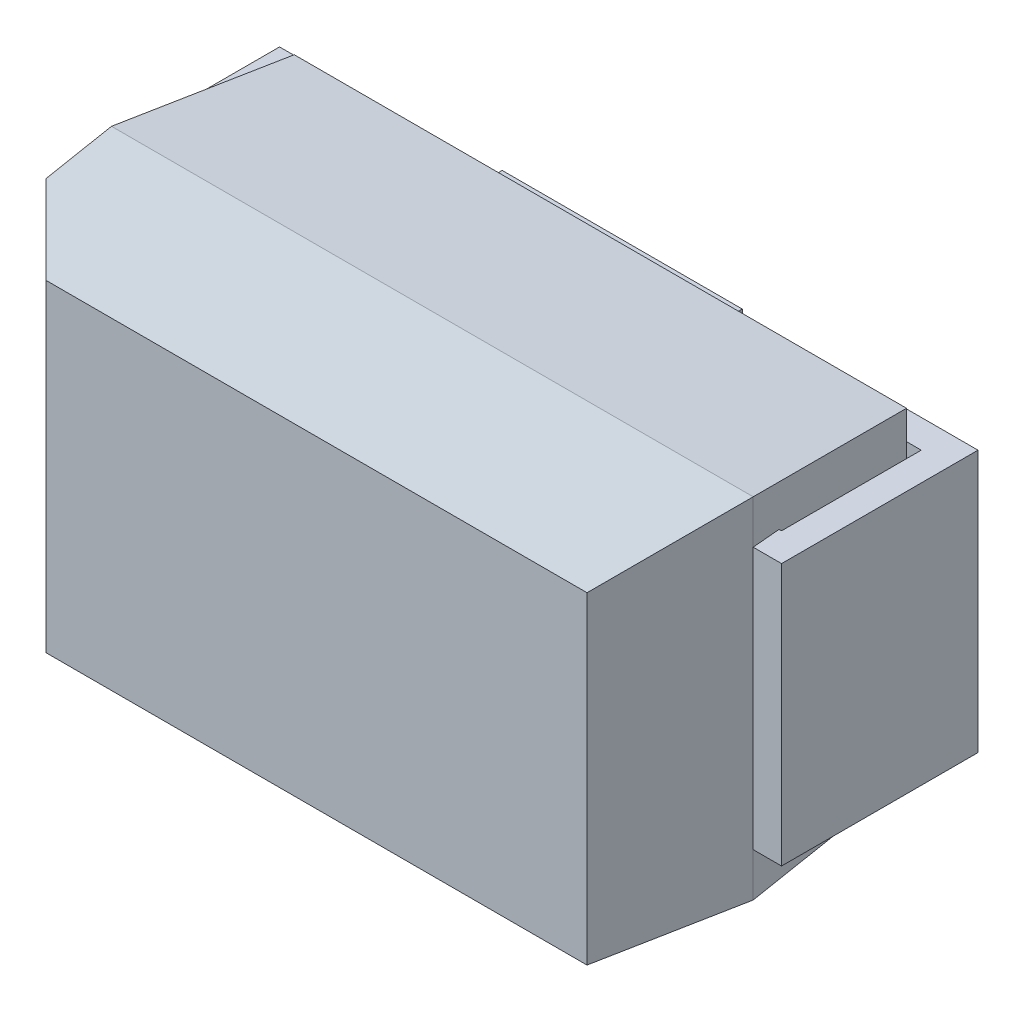
ISO-10303-21;
HEADER;
FILE_DESCRIPTION(('STEP AP214'),'2;1');
FILE_NAME('part.step','',(''),(''),'','','');
FILE_SCHEMA(('AUTOMOTIVE_DESIGN { 1 0 10303 214 1 1 1 1 }'));
ENDSEC;
DATA;
#1=APPLICATION_CONTEXT('core data for automotive mechanical design processes');
#2=APPLICATION_PROTOCOL_DEFINITION('international standard','automotive_design',2000,#1);
#3=PRODUCT_CONTEXT('',#1,'mechanical');
#4=PRODUCT('Part','Part','',(#3));
#5=PRODUCT_RELATED_PRODUCT_CATEGORY('part','',(#4));
#6=PRODUCT_DEFINITION_FORMATION('','',#4);
#7=PRODUCT_DEFINITION_CONTEXT('part definition',#1,'design');
#8=PRODUCT_DEFINITION('design','',#6,#7);
#9=PRODUCT_DEFINITION_SHAPE('','',#8);
#10=(LENGTH_UNIT() NAMED_UNIT(*) SI_UNIT(.MILLI.,.METRE.));
#11=(NAMED_UNIT(*) PLANE_ANGLE_UNIT() SI_UNIT($,.RADIAN.));
#12=(NAMED_UNIT(*) SI_UNIT($,.STERADIAN.) SOLID_ANGLE_UNIT());
#13=UNCERTAINTY_MEASURE_WITH_UNIT(LENGTH_MEASURE(1.E-05),#10,'distance_accuracy_value','');
#14=(GEOMETRIC_REPRESENTATION_CONTEXT(3) GLOBAL_UNCERTAINTY_ASSIGNED_CONTEXT((#13)) GLOBAL_UNIT_ASSIGNED_CONTEXT((#10,
#11,#12)) REPRESENTATION_CONTEXT('',''));
#15=CARTESIAN_POINT('',(0.,0.,0.));
#16=DIRECTION('',(0.,0.,1.));
#17=DIRECTION('',(1.,0.,0.));
#18=AXIS2_PLACEMENT_3D('',#15,#16,#17);
#19=CARTESIAN_POINT('',(1.616,-0.624,0.));
#20=DIRECTION('',(0.,0.,-1.));
#21=DIRECTION('',(-1.,0.,0.));
#22=AXIS2_PLACEMENT_3D('',#19,#20,#21);
#23=PLANE('',#22);
#24=DIRECTION('',(-1.,0.,0.));
#25=VECTOR('',#24,1.);
#26=CARTESIAN_POINT('',(0.,0.6,0.));
#27=LINE('',#26,#25);
#28=CARTESIAN_POINT('',(0.8,0.6,0.));
#29=VERTEX_POINT('',#28);
#30=CARTESIAN_POINT('',(1.6,0.6,0.));
#31=VERTEX_POINT('',#30);
#32=EDGE_CURVE('E356',#29,#31,#27,.F.);
#33=ORIENTED_EDGE('',*,*,#32,.T.);
#34=DIRECTION('',(0.,1.,0.));
#35=VECTOR('',#34,1.);
#36=CARTESIAN_POINT('',(1.6,0.,0.));
#37=LINE('',#36,#35);
#38=CARTESIAN_POINT('',(1.6,-0.6,0.));
#39=VERTEX_POINT('',#38);
#40=EDGE_CURVE('E384',#31,#39,#37,.F.);
#41=ORIENTED_EDGE('',*,*,#40,.T.);
#42=DIRECTION('',(-1.,0.,0.));
#43=VECTOR('',#42,1.);
#44=CARTESIAN_POINT('',(0.,-0.6,0.));
#45=LINE('',#44,#43);
#46=CARTESIAN_POINT('',(0.8,-0.6,0.));
#47=VERTEX_POINT('',#46);
#48=EDGE_CURVE('E367',#39,#47,#45,.T.);
#49=ORIENTED_EDGE('',*,*,#48,.T.);
#50=DIRECTION('',(0.,-1.,0.));
#51=VECTOR('',#50,1.);
#52=CARTESIAN_POINT('',(0.8,0.,0.));
#53=LINE('',#52,#51);
#54=EDGE_CURVE('E362',#47,#29,#53,.F.);
#55=ORIENTED_EDGE('',*,*,#54,.T.);
#56=EDGE_LOOP('',(#33,#41,#49,#55));
#57=FACE_BOUND('',#56,.T.);
#58=ADVANCED_FACE('F16',(#57),#23,.T.);
#59=CARTESIAN_POINT('',(1.47,-0.624,0.1172));
#60=DIRECTION('',(-1.,0.,0.));
#61=DIRECTION('',(0.,0.,1.));
#62=AXIS2_PLACEMENT_3D('',#59,#60,#61);
#63=PLANE('',#62);
#64=DIRECTION('',(0.,0.,1.));
#65=VECTOR('',#64,1.);
#66=CARTESIAN_POINT('',(1.47,0.6,0.45));
#67=LINE('',#66,#65);
#68=CARTESIAN_POINT('',(1.47,0.6,0.77));
#69=VERTEX_POINT('',#68);
#70=CARTESIAN_POINT('',(1.47,0.6,0.13));
#71=VERTEX_POINT('',#70);
#72=EDGE_CURVE('E348',#69,#71,#67,.F.);
#73=ORIENTED_EDGE('',*,*,#72,.T.);
#74=DIRECTION('',(0.,1.,0.));
#75=VECTOR('',#74,1.);
#76=CARTESIAN_POINT('',(1.47,0.,0.13));
#77=LINE('',#76,#75);
#78=CARTESIAN_POINT('',(1.47,-0.6,0.13));
#79=VERTEX_POINT('',#78);
#80=EDGE_CURVE('E382',#71,#79,#77,.F.);
#81=ORIENTED_EDGE('',*,*,#80,.T.);
#82=DIRECTION('',(0.,0.,1.));
#83=VECTOR('',#82,1.);
#84=CARTESIAN_POINT('',(1.47,-0.6,0.45));
#85=LINE('',#84,#83);
#86=CARTESIAN_POINT('',(1.47,-0.6,0.77));
#87=VERTEX_POINT('',#86);
#88=EDGE_CURVE('E374',#79,#87,#85,.T.);
#89=ORIENTED_EDGE('',*,*,#88,.T.);
#90=DIRECTION('',(0.,-1.,0.));
#91=VECTOR('',#90,1.);
#92=CARTESIAN_POINT('',(1.47,0.,0.77));
#93=LINE('',#92,#91);
#94=EDGE_CURVE('E380',#87,#69,#93,.F.);
#95=ORIENTED_EDGE('',*,*,#94,.T.);
#96=EDGE_LOOP('',(#73,#81,#89,#95));
#97=FACE_BOUND('',#96,.T.);
#98=ADVANCED_FACE('F621',(#97),#63,.T.);
#99=CARTESIAN_POINT('',(-0.572,-0.676,0.03));
#100=DIRECTION('',(0.,0.,1.));
#101=DIRECTION('',(1.,0.,0.));
#102=AXIS2_PLACEMENT_3D('',#99,#100,#101);
#103=PLANE('',#102);
#104=DIRECTION('',(0.,1.,0.));
#105=VECTOR('',#104,1.);
#106=CARTESIAN_POINT('',(0.55,0.,0.03));
#107=LINE('',#106,#105);
#108=CARTESIAN_POINT('',(0.55,0.65,0.03));
#109=VERTEX_POINT('',#108);
#110=CARTESIAN_POINT('',(0.55,-0.65,0.03));
#111=VERTEX_POINT('',#110);
#112=EDGE_CURVE('E331',#109,#111,#107,.F.);
#113=ORIENTED_EDGE('',*,*,#112,.T.);
#114=DIRECTION('',(1.,0.,0.));
#115=VECTOR('',#114,1.);
#116=CARTESIAN_POINT('',(0.,-0.65,0.03));
#117=LINE('',#116,#115);
#118=CARTESIAN_POINT('',(-0.55,-0.65,0.03));
#119=VERTEX_POINT('',#118);
#120=EDGE_CURVE('E325',#111,#119,#117,.F.);
#121=ORIENTED_EDGE('',*,*,#120,.T.);
#122=DIRECTION('',(0.,-1.,0.));
#123=VECTOR('',#122,1.);
#124=CARTESIAN_POINT('',(-0.55,0.,0.03));
#125=LINE('',#124,#123);
#126=CARTESIAN_POINT('',(-0.55,0.65,0.03));
#127=VERTEX_POINT('',#126);
#128=EDGE_CURVE('E341',#119,#127,#125,.F.);
#129=ORIENTED_EDGE('',*,*,#128,.T.);
#130=DIRECTION('',(-1.,0.,0.));
#131=VECTOR('',#130,1.);
#132=CARTESIAN_POINT('',(0.,0.65,0.03));
#133=LINE('',#132,#131);
#134=EDGE_CURVE('E336',#127,#109,#133,.F.);
#135=ORIENTED_EDGE('',*,*,#134,.T.);
#136=EDGE_LOOP('',(#113,#121,#129,#135));
#137=FACE_BOUND('',#136,.T.);
#138=ADVANCED_FACE('F617',(#137),#103,.F.);
#139=CARTESIAN_POINT('',(-0.784,-0.624,0.));
#140=DIRECTION('',(0.,0.,-1.));
#141=DIRECTION('',(-1.,0.,0.));
#142=AXIS2_PLACEMENT_3D('',#139,#140,#141);
#143=PLANE('',#142);
#144=DIRECTION('',(-1.,0.,0.));
#145=VECTOR('',#144,1.);
#146=CARTESIAN_POINT('',(0.,0.6,0.));
#147=LINE('',#146,#145);
#148=CARTESIAN_POINT('',(-1.6,0.6,0.));
#149=VERTEX_POINT('',#148);
#150=CARTESIAN_POINT('',(-0.8,0.6,0.));
#151=VERTEX_POINT('',#150);
#152=EDGE_CURVE('E308',#149,#151,#147,.F.);
#153=ORIENTED_EDGE('',*,*,#152,.T.);
#154=DIRECTION('',(0.,1.,0.));
#155=VECTOR('',#154,1.);
#156=CARTESIAN_POINT('',(-0.8,0.,0.));
#157=LINE('',#156,#155);
#158=CARTESIAN_POINT('',(-0.8,-0.6,0.));
#159=VERTEX_POINT('',#158);
#160=EDGE_CURVE('E343',#151,#159,#157,.F.);
#161=ORIENTED_EDGE('',*,*,#160,.T.);
#162=DIRECTION('',(-1.,0.,0.));
#163=VECTOR('',#162,1.);
#164=CARTESIAN_POINT('',(0.,-0.6,0.));
#165=LINE('',#164,#163);
#166=CARTESIAN_POINT('',(-1.6,-0.6,0.));
#167=VERTEX_POINT('',#166);
#168=EDGE_CURVE('E295',#159,#167,#165,.T.);
#169=ORIENTED_EDGE('',*,*,#168,.T.);
#170=DIRECTION('',(0.,-1.,0.));
#171=VECTOR('',#170,1.);
#172=CARTESIAN_POINT('',(-1.6,0.,0.));
#173=LINE('',#172,#171);
#174=EDGE_CURVE('E388',#167,#149,#173,.F.);
#175=ORIENTED_EDGE('',*,*,#174,.T.);
#176=EDGE_LOOP('',(#153,#161,#169,#175));
#177=FACE_BOUND('',#176,.T.);
#178=ADVANCED_FACE('F613',(#177),#143,.T.);
#179=CARTESIAN_POINT('',(-1.6,-0.624,-0.018));
#180=DIRECTION('',(-1.,0.,0.));
#181=DIRECTION('',(0.,0.,1.));
#182=AXIS2_PLACEMENT_3D('',#179,#180,#181);
#183=PLANE('',#182);
#184=DIRECTION('',(0.,0.,1.));
#185=VECTOR('',#184,1.);
#186=CARTESIAN_POINT('',(-1.6,0.6,0.45));
#187=LINE('',#186,#185);
#188=CARTESIAN_POINT('',(-1.6,0.6,0.9));
#189=VERTEX_POINT('',#188);
#190=EDGE_CURVE('E311',#189,#149,#187,.F.);
#191=ORIENTED_EDGE('',*,*,#190,.T.);
#192=ORIENTED_EDGE('',*,*,#174,.F.);
#193=DIRECTION('',(0.,0.,1.));
#194=VECTOR('',#193,1.);
#195=CARTESIAN_POINT('',(-1.6,-0.6,0.45));
#196=LINE('',#195,#194);
#197=CARTESIAN_POINT('',(-1.6,-0.6,0.9));
#198=VERTEX_POINT('',#197);
#199=EDGE_CURVE('E292',#167,#198,#196,.T.);
#200=ORIENTED_EDGE('',*,*,#199,.T.);
#201=DIRECTION('',(0.,-1.,0.));
#202=VECTOR('',#201,1.);
#203=CARTESIAN_POINT('',(-1.6,0.,0.9));
#204=LINE('',#203,#202);
#205=EDGE_CURVE('E386',#198,#189,#204,.F.);
#206=ORIENTED_EDGE('',*,*,#205,.T.);
#207=EDGE_LOOP('',(#191,#192,#200,#206));
#208=FACE_BOUND('',#207,.T.);
#209=ADVANCED_FACE('F609',(#208),#183,.T.);
#210=CARTESIAN_POINT('',(-1.47,-0.624,0.7828));
#211=DIRECTION('',(1.,0.,0.));
#212=DIRECTION('',(0.,0.,-1.));
#213=AXIS2_PLACEMENT_3D('',#210,#211,#212);
#214=PLANE('',#213);
#215=DIRECTION('',(0.,0.,-1.));
#216=VECTOR('',#215,1.);
#217=CARTESIAN_POINT('',(-1.47,0.6,0.45));
#218=LINE('',#217,#216);
#219=CARTESIAN_POINT('',(-1.47,0.6,0.13));
#220=VERTEX_POINT('',#219);
#221=CARTESIAN_POINT('',(-1.47,0.6,0.77));
#222=VERTEX_POINT('',#221);
#223=EDGE_CURVE('E315',#220,#222,#218,.F.);
#224=ORIENTED_EDGE('',*,*,#223,.T.);
#225=DIRECTION('',(0.,1.,0.));
#226=VECTOR('',#225,1.);
#227=CARTESIAN_POINT('',(-1.47,0.,0.77));
#228=LINE('',#227,#226);
#229=CARTESIAN_POINT('',(-1.47,-0.6,0.77));
#230=VERTEX_POINT('',#229);
#231=EDGE_CURVE('E301',#222,#230,#228,.F.);
#232=ORIENTED_EDGE('',*,*,#231,.T.);
#233=DIRECTION('',(0.,0.,-1.));
#234=VECTOR('',#233,1.);
#235=CARTESIAN_POINT('',(-1.47,-0.6,0.45));
#236=LINE('',#235,#234);
#237=CARTESIAN_POINT('',(-1.47,-0.6,0.13));
#238=VERTEX_POINT('',#237);
#239=EDGE_CURVE('E281',#230,#238,#236,.T.);
#240=ORIENTED_EDGE('',*,*,#239,.T.);
#241=DIRECTION('',(0.,-1.,0.));
#242=VECTOR('',#241,1.);
#243=CARTESIAN_POINT('',(-1.47,0.,0.13));
#244=LINE('',#243,#242);
#245=EDGE_CURVE('E320',#238,#220,#244,.F.);
#246=ORIENTED_EDGE('',*,*,#245,.T.);
#247=EDGE_LOOP('',(#224,#232,#240,#246));
#248=FACE_BOUND('',#247,.T.);
#249=ADVANCED_FACE('F606',(#248),#214,.T.);
#250=CARTESIAN_POINT('',(-1.604703020306,-0.624,0.9));
#251=DIRECTION('',(0.,0.,1.));
#252=DIRECTION('',(1.,0.,0.));
#253=AXIS2_PLACEMENT_3D('',#250,#251,#252);
#254=PLANE('',#253);
#255=ORIENTED_EDGE('',*,*,#205,.F.);
#256=DIRECTION('',(1.,0.,0.));
#257=VECTOR('',#256,1.);
#258=CARTESIAN_POINT('',(0.,-0.6,0.9));
#259=LINE('',#258,#257);
#260=CARTESIAN_POINT('',(-1.46999999999999,-0.6,0.900000000000005));
#261=VERTEX_POINT('',#260);
#262=EDGE_CURVE('E290',#198,#261,#259,.T.);
#263=ORIENTED_EDGE('',*,*,#262,.T.);
#264=DIRECTION('',(0.,-1.,0.));
#265=VECTOR('',#264,1.);
#266=CARTESIAN_POINT('',(-1.47000000000021,0.,0.900000000000018));
#267=LINE('',#266,#265);
#268=CARTESIAN_POINT('',(-1.47000000000002,0.6,0.900000000000008));
#269=VERTEX_POINT('',#268);
#270=EDGE_CURVE('E274',#261,#269,#267,.F.);
#271=ORIENTED_EDGE('',*,*,#270,.T.);
#272=DIRECTION('',(1.,0.,0.));
#273=VECTOR('',#272,1.);
#274=CARTESIAN_POINT('',(0.,0.6,0.9));
#275=LINE('',#274,#273);
#276=EDGE_CURVE('E82',#269,#189,#275,.F.);
#277=ORIENTED_EDGE('',*,*,#276,.T.);
#278=EDGE_LOOP('',(#255,#263,#271,#277));
#279=FACE_BOUND('',#278,.T.);
#280=ADVANCED_FACE('F491',(#279),#254,.T.);
#281=CARTESIAN_POINT('',(1.6,-0.624,0.918));
#282=DIRECTION('',(1.,0.,0.));
#283=DIRECTION('',(0.,0.,-1.));
#284=AXIS2_PLACEMENT_3D('',#281,#282,#283);
#285=PLANE('',#284);
#286=DIRECTION('',(0.,0.,-1.));
#287=VECTOR('',#286,1.);
#288=CARTESIAN_POINT('',(1.6,0.6,0.45));
#289=LINE('',#288,#287);
#290=CARTESIAN_POINT('',(1.6,0.6,0.9));
#291=VERTEX_POINT('',#290);
#292=EDGE_CURVE('E354',#31,#291,#289,.F.);
#293=ORIENTED_EDGE('',*,*,#292,.T.);
#294=DIRECTION('',(0.,1.,0.));
#295=VECTOR('',#294,1.);
#296=CARTESIAN_POINT('',(1.6,0.,0.9));
#297=LINE('',#296,#295);
#298=CARTESIAN_POINT('',(1.6,-0.6,0.9));
#299=VERTEX_POINT('',#298);
#300=EDGE_CURVE('E272',#291,#299,#297,.F.);
#301=ORIENTED_EDGE('',*,*,#300,.T.);
#302=DIRECTION('',(0.,0.,-1.));
#303=VECTOR('',#302,1.);
#304=CARTESIAN_POINT('',(1.6,-0.6,0.45));
#305=LINE('',#304,#303);
#306=EDGE_CURVE('E369',#299,#39,#305,.T.);
#307=ORIENTED_EDGE('',*,*,#306,.T.);
#308=ORIENTED_EDGE('',*,*,#40,.F.);
#309=EDGE_LOOP('',(#293,#301,#307,#308));
#310=FACE_BOUND('',#309,.T.);
#311=ADVANCED_FACE('F461',(#310),#285,.T.);
#312=CARTESIAN_POINT('',(1.397930708779,-0.624,0.13));
#313=DIRECTION('',(0.,0.,1.));
#314=DIRECTION('',(1.,0.,0.));
#315=AXIS2_PLACEMENT_3D('',#312,#313,#314);
#316=PLANE('',#315);
#317=ORIENTED_EDGE('',*,*,#80,.F.);
#318=DIRECTION('',(1.,0.,0.));
#319=VECTOR('',#318,1.);
#320=CARTESIAN_POINT('',(0.,0.6,0.13));
#321=LINE('',#320,#319);
#322=CARTESIAN_POINT('',(1.40263372908504,0.6,0.129999999999997));
#323=VERTEX_POINT('',#322);
#324=EDGE_CURVE('E345',#71,#323,#321,.F.);
#325=ORIENTED_EDGE('',*,*,#324,.T.);
#326=DIRECTION('',(0.,1.,0.));
#327=VECTOR('',#326,1.);
#328=CARTESIAN_POINT('',(1.40263372908529,0.,0.129999999999975));
#329=LINE('',#328,#327);
#330=CARTESIAN_POINT('',(1.40263372908504,-0.6,0.129999999999997));
#331=VERTEX_POINT('',#330);
#332=EDGE_CURVE('E453',#323,#331,#329,.F.);
#333=ORIENTED_EDGE('',*,*,#332,.T.);
#334=DIRECTION('',(1.,0.,0.));
#335=VECTOR('',#334,1.);
#336=CARTESIAN_POINT('',(0.,-0.6,0.13));
#337=LINE('',#336,#335);
#338=EDGE_CURVE('E377',#331,#79,#337,.T.);
#339=ORIENTED_EDGE('',*,*,#338,.T.);
#340=EDGE_LOOP('',(#317,#325,#333,#339));
#341=FACE_BOUND('',#340,.T.);
#342=ADVANCED_FACE('F523',(#341),#316,.T.);
#343=CARTESIAN_POINT('',(1.5288,-0.624,0.77));
#344=DIRECTION('',(0.,0.,-1.));
#345=DIRECTION('',(-1.,0.,0.));
#346=AXIS2_PLACEMENT_3D('',#343,#344,#345);
#347=PLANE('',#346);
#348=ORIENTED_EDGE('',*,*,#94,.F.);
#349=DIRECTION('',(-1.,0.,0.));
#350=VECTOR('',#349,1.);
#351=CARTESIAN_POINT('',(0.,-0.6,0.77));
#352=LINE('',#351,#350);
#353=CARTESIAN_POINT('',(1.45862647374186,-0.6,0.770000000000012));
#354=VERTEX_POINT('',#353);
#355=EDGE_CURVE('E372',#87,#354,#352,.T.);
#356=ORIENTED_EDGE('',*,*,#355,.T.);
#357=DIRECTION('',(0.,-1.,0.));
#358=VECTOR('',#357,1.);
#359=CARTESIAN_POINT('',(1.45862647374144,0.,0.770000000000049));
#360=LINE('',#359,#358);
#361=CARTESIAN_POINT('',(1.45862647374186,0.6,0.770000000000012));
#362=VERTEX_POINT('',#361);
#363=EDGE_CURVE('E447',#354,#362,#360,.F.);
#364=ORIENTED_EDGE('',*,*,#363,.T.);
#365=DIRECTION('',(-1.,0.,0.));
#366=VECTOR('',#365,1.);
#367=CARTESIAN_POINT('',(0.,0.6,0.77));
#368=LINE('',#367,#366);
#369=EDGE_CURVE('E351',#362,#69,#368,.F.);
#370=ORIENTED_EDGE('',*,*,#369,.T.);
#371=EDGE_LOOP('',(#348,#356,#364,#370));
#372=FACE_BOUND('',#371,.T.);
#373=ADVANCED_FACE('F596',(#372),#347,.T.);
#374=CARTESIAN_POINT('',(-1.664,-0.6,0.918));
#375=DIRECTION('',(0.,1.,0.));
#376=DIRECTION('',(1.,0.,0.));
#377=AXIS2_PLACEMENT_3D('',#374,#375,#376);
#378=PLANE('',#377);
#379=ORIENTED_EDGE('',*,*,#48,.F.);
#380=ORIENTED_EDGE('',*,*,#306,.F.);
#381=DIRECTION('',(1.,0.,0.));
#382=VECTOR('',#381,1.);
#383=CARTESIAN_POINT('',(1.535,-0.6,0.9));
#384=LINE('',#383,#382);
#385=CARTESIAN_POINT('',(1.46999999999992,-0.6,0.899999999999999));
#386=VERTEX_POINT('',#385);
#387=EDGE_CURVE('E456',#299,#386,#384,.F.);
#388=ORIENTED_EDGE('',*,*,#387,.T.);
#389=DIRECTION('',(0.0871557427469669,0.,0.996194698091806));
#390=VECTOR('',#389,1.);
#391=CARTESIAN_POINT('',(1.4363168645425,-0.6,0.515));
#392=LINE('',#391,#390);
#393=EDGE_CURVE('E450',#386,#354,#392,.F.);
#394=ORIENTED_EDGE('',*,*,#393,.T.);
#395=ORIENTED_EDGE('',*,*,#355,.F.);
#396=ORIENTED_EDGE('',*,*,#88,.F.);
#397=ORIENTED_EDGE('',*,*,#338,.F.);
#398=DIRECTION('',(1.,0.,0.));
#399=VECTOR('',#398,1.);
#400=CARTESIAN_POINT('',(0.,-0.6,0.13));
#401=LINE('',#400,#399);
#402=CARTESIAN_POINT('',(0.8,-0.6,0.13));
#403=VERTEX_POINT('',#402);
#404=EDGE_CURVE('E266',#331,#403,#401,.F.);
#405=ORIENTED_EDGE('',*,*,#404,.T.);
#406=DIRECTION('',(0.,0.,1.));
#407=VECTOR('',#406,1.);
#408=CARTESIAN_POINT('',(0.8,-0.6,0.064999999999978));
#409=LINE('',#408,#407);
#410=EDGE_CURVE('E364',#403,#47,#409,.F.);
#411=ORIENTED_EDGE('',*,*,#410,.T.);
#412=EDGE_LOOP('',(#379,#380,#388,#394,#395,#396,#397,#405,#411));
#413=FACE_BOUND('',#412,.T.);
#414=ADVANCED_FACE('F511',(#413),#378,.F.);
#415=CARTESIAN_POINT('',(0.8,-0.624,-0.004703020306144));
#416=DIRECTION('',(-1.,0.,0.));
#417=DIRECTION('',(0.,0.,1.));
#418=AXIS2_PLACEMENT_3D('',#415,#416,#417);
#419=PLANE('',#418);
#420=ORIENTED_EDGE('',*,*,#54,.F.);
#421=ORIENTED_EDGE('',*,*,#410,.F.);
#422=DIRECTION('',(0.,-1.,0.));
#423=VECTOR('',#422,1.);
#424=CARTESIAN_POINT('',(0.8,0.,0.13));
#425=LINE('',#424,#423);
#426=CARTESIAN_POINT('',(0.8,0.6,0.13));
#427=VERTEX_POINT('',#426);
#428=EDGE_CURVE('E440',#403,#427,#425,.F.);
#429=ORIENTED_EDGE('',*,*,#428,.T.);
#430=DIRECTION('',(0.,0.,1.));
#431=VECTOR('',#430,1.);
#432=CARTESIAN_POINT('',(0.8,0.6,0.45));
#433=LINE('',#432,#431);
#434=EDGE_CURVE('E359',#427,#29,#433,.F.);
#435=ORIENTED_EDGE('',*,*,#434,.T.);
#436=EDGE_LOOP('',(#420,#421,#429,#435));
#437=FACE_BOUND('',#436,.T.);
#438=ADVANCED_FACE('F515',(#437),#419,.T.);
#439=CARTESIAN_POINT('',(-1.664,0.6,0.918));
#440=DIRECTION('',(0.,1.,0.));
#441=DIRECTION('',(1.,0.,0.));
#442=AXIS2_PLACEMENT_3D('',#439,#440,#441);
#443=PLANE('',#442);
#444=ORIENTED_EDGE('',*,*,#72,.F.);
#445=ORIENTED_EDGE('',*,*,#369,.F.);
#446=DIRECTION('',(-0.0871557427469672,0.,-0.996194698091806));
#447=VECTOR('',#446,1.);
#448=CARTESIAN_POINT('',(1.4363168645425,0.6,0.515));
#449=LINE('',#448,#447);
#450=CARTESIAN_POINT('',(1.46999999999992,0.6,0.899999999999999));
#451=VERTEX_POINT('',#450);
#452=EDGE_CURVE('E267',#362,#451,#449,.F.);
#453=ORIENTED_EDGE('',*,*,#452,.T.);
#454=DIRECTION('',(-1.,0.,0.));
#455=VECTOR('',#454,1.);
#456=CARTESIAN_POINT('',(1.535,0.6,0.9));
#457=LINE('',#456,#455);
#458=EDGE_CURVE('E269',#451,#291,#457,.F.);
#459=ORIENTED_EDGE('',*,*,#458,.T.);
#460=ORIENTED_EDGE('',*,*,#292,.F.);
#461=ORIENTED_EDGE('',*,*,#32,.F.);
#462=ORIENTED_EDGE('',*,*,#434,.F.);
#463=DIRECTION('',(-1.,0.,0.));
#464=VECTOR('',#463,1.);
#465=CARTESIAN_POINT('',(0.,0.6,0.13));
#466=LINE('',#465,#464);
#467=EDGE_CURVE('E406',#427,#323,#466,.F.);
#468=ORIENTED_EDGE('',*,*,#467,.T.);
#469=ORIENTED_EDGE('',*,*,#324,.F.);
#470=EDGE_LOOP('',(#444,#445,#453,#459,#460,#461,#462,#468,#469));
#471=FACE_BOUND('',#470,.T.);
#472=ADVANCED_FACE('F471',(#471),#443,.T.);
#473=CARTESIAN_POINT('',(-0.8,-0.624,0.1347030203061));
#474=DIRECTION('',(1.,0.,0.));
#475=DIRECTION('',(0.,0.,-1.));
#476=AXIS2_PLACEMENT_3D('',#473,#474,#475);
#477=PLANE('',#476);
#478=ORIENTED_EDGE('',*,*,#160,.F.);
#479=DIRECTION('',(0.,0.,-1.));
#480=VECTOR('',#479,1.);
#481=CARTESIAN_POINT('',(-0.8,0.6,0.45));
#482=LINE('',#481,#480);
#483=CARTESIAN_POINT('',(-0.8,0.6,0.13));
#484=VERTEX_POINT('',#483);
#485=EDGE_CURVE('E306',#151,#484,#482,.F.);
#486=ORIENTED_EDGE('',*,*,#485,.T.);
#487=DIRECTION('',(0.,1.,0.));
#488=VECTOR('',#487,1.);
#489=CARTESIAN_POINT('',(-0.8,0.,0.13));
#490=LINE('',#489,#488);
#491=CARTESIAN_POINT('',(-0.8,-0.6,0.13));
#492=VERTEX_POINT('',#491);
#493=EDGE_CURVE('E433',#484,#492,#490,.F.);
#494=ORIENTED_EDGE('',*,*,#493,.T.);
#495=DIRECTION('',(0.,0.,-1.));
#496=VECTOR('',#495,1.);
#497=CARTESIAN_POINT('',(-0.8,-0.6,0.45));
#498=LINE('',#497,#496);
#499=EDGE_CURVE('E298',#492,#159,#498,.T.);
#500=ORIENTED_EDGE('',*,*,#499,.T.);
#501=EDGE_LOOP('',(#478,#486,#494,#500));
#502=FACE_BOUND('',#501,.T.);
#503=ADVANCED_FACE('F585',(#502),#477,.T.);
#504=CARTESIAN_POINT('',(-0.55,0.676,0.02529697969386));
#505=DIRECTION('',(-1.,0.,0.));
#506=DIRECTION('',(0.,-1.,0.));
#507=AXIS2_PLACEMENT_3D('',#504,#505,#506);
#508=PLANE('',#507);
#509=ORIENTED_EDGE('',*,*,#128,.F.);
#510=DIRECTION('',(0.,0.,-1.));
#511=VECTOR('',#510,1.);
#512=CARTESIAN_POINT('',(-0.55,-0.65,0.07999999999998));
#513=LINE('',#512,#511);
#514=CARTESIAN_POINT('',(-0.55,-0.65,0.13));
#515=VERTEX_POINT('',#514);
#516=EDGE_CURVE('E322',#119,#515,#513,.F.);
#517=ORIENTED_EDGE('',*,*,#516,.T.);
#518=DIRECTION('',(0.,-1.,0.));
#519=VECTOR('',#518,1.);
#520=CARTESIAN_POINT('',(-0.55,0.,0.13));
#521=LINE('',#520,#519);
#522=CARTESIAN_POINT('',(-0.55,0.65,0.13));
#523=VERTEX_POINT('',#522);
#524=EDGE_CURVE('E239',#515,#523,#521,.F.);
#525=ORIENTED_EDGE('',*,*,#524,.T.);
#526=DIRECTION('',(0.,0.,1.));
#527=VECTOR('',#526,1.);
#528=CARTESIAN_POINT('',(-0.55,0.65,0.07999999999998));
#529=LINE('',#528,#527);
#530=EDGE_CURVE('E338',#523,#127,#529,.F.);
#531=ORIENTED_EDGE('',*,*,#530,.T.);
#532=EDGE_LOOP('',(#509,#517,#525,#531));
#533=FACE_BOUND('',#532,.T.);
#534=ADVANCED_FACE('F581',(#533),#508,.T.);
#535=CARTESIAN_POINT('',(0.572,0.65,0.02529697969386));
#536=DIRECTION('',(0.,1.,0.));
#537=DIRECTION('',(-1.,0.,0.));
#538=AXIS2_PLACEMENT_3D('',#535,#536,#537);
#539=PLANE('',#538);
#540=ORIENTED_EDGE('',*,*,#134,.F.);
#541=ORIENTED_EDGE('',*,*,#530,.F.);
#542=DIRECTION('',(-1.,0.,0.));
#543=VECTOR('',#542,1.);
#544=CARTESIAN_POINT('',(0.,0.65,0.13));
#545=LINE('',#544,#543);
#546=CARTESIAN_POINT('',(0.55,0.65,0.13));
#547=VERTEX_POINT('',#546);
#548=EDGE_CURVE('E426',#523,#547,#545,.F.);
#549=ORIENTED_EDGE('',*,*,#548,.T.);
#550=DIRECTION('',(0.,0.,1.));
#551=VECTOR('',#550,1.);
#552=CARTESIAN_POINT('',(0.55,0.65,0.07999999999998));
#553=LINE('',#552,#551);
#554=EDGE_CURVE('E333',#547,#109,#553,.F.);
#555=ORIENTED_EDGE('',*,*,#554,.T.);
#556=EDGE_LOOP('',(#540,#541,#549,#555));
#557=FACE_BOUND('',#556,.T.);
#558=ADVANCED_FACE('F577',(#557),#539,.T.);
#559=CARTESIAN_POINT('',(0.55,-0.676,0.02529697969386));
#560=DIRECTION('',(1.,0.,0.));
#561=DIRECTION('',(0.,1.,0.));
#562=AXIS2_PLACEMENT_3D('',#559,#560,#561);
#563=PLANE('',#562);
#564=ORIENTED_EDGE('',*,*,#112,.F.);
#565=ORIENTED_EDGE('',*,*,#554,.F.);
#566=DIRECTION('',(0.,1.,0.));
#567=VECTOR('',#566,1.);
#568=CARTESIAN_POINT('',(0.55,0.,0.13));
#569=LINE('',#568,#567);
#570=CARTESIAN_POINT('',(0.55,-0.65,0.13));
#571=VERTEX_POINT('',#570);
#572=EDGE_CURVE('E419',#547,#571,#569,.F.);
#573=ORIENTED_EDGE('',*,*,#572,.T.);
#574=DIRECTION('',(0.,0.,1.));
#575=VECTOR('',#574,1.);
#576=CARTESIAN_POINT('',(0.55,-0.65,0.07999999999998));
#577=LINE('',#576,#575);
#578=EDGE_CURVE('E328',#571,#111,#577,.F.);
#579=ORIENTED_EDGE('',*,*,#578,.T.);
#580=EDGE_LOOP('',(#564,#565,#573,#579));
#581=FACE_BOUND('',#580,.T.);
#582=ADVANCED_FACE('F573',(#581),#563,.T.);
#583=CARTESIAN_POINT('',(-0.572,-0.65,0.02529697969386));
#584=DIRECTION('',(0.,-1.,0.));
#585=DIRECTION('',(1.,0.,0.));
#586=AXIS2_PLACEMENT_3D('',#583,#584,#585);
#587=PLANE('',#586);
#588=ORIENTED_EDGE('',*,*,#120,.F.);
#589=ORIENTED_EDGE('',*,*,#578,.F.);
#590=DIRECTION('',(1.,0.,0.));
#591=VECTOR('',#590,1.);
#592=CARTESIAN_POINT('',(0.,-0.65,0.13));
#593=LINE('',#592,#591);
#594=EDGE_CURVE('E414',#571,#515,#593,.F.);
#595=ORIENTED_EDGE('',*,*,#594,.T.);
#596=ORIENTED_EDGE('',*,*,#516,.F.);
#597=EDGE_LOOP('',(#588,#589,#595,#596));
#598=FACE_BOUND('',#597,.T.);
#599=ADVANCED_FACE('F570',(#598),#587,.T.);
#600=CARTESIAN_POINT('',(-1.474703020306,-0.624,0.13));
#601=DIRECTION('',(0.,0.,1.));
#602=DIRECTION('',(1.,0.,0.));
#603=AXIS2_PLACEMENT_3D('',#600,#601,#602);
#604=PLANE('',#603);
#605=ORIENTED_EDGE('',*,*,#245,.F.);
#606=DIRECTION('',(1.,0.,0.));
#607=VECTOR('',#606,1.);
#608=CARTESIAN_POINT('',(0.,-0.6,0.13));
#609=LINE('',#608,#607);
#610=CARTESIAN_POINT('',(-1.40263372908504,-0.6,0.129999999999997));
#611=VERTEX_POINT('',#610);
#612=EDGE_CURVE('E275',#238,#611,#609,.T.);
#613=ORIENTED_EDGE('',*,*,#612,.T.);
#614=DIRECTION('',(0.,-1.,0.));
#615=VECTOR('',#614,1.);
#616=CARTESIAN_POINT('',(-1.40263372908529,0.,0.129999999999975));
#617=LINE('',#616,#615);
#618=CARTESIAN_POINT('',(-1.40263372908504,0.6,0.129999999999997));
#619=VERTEX_POINT('',#618);
#620=EDGE_CURVE('E408',#611,#619,#617,.F.);
#621=ORIENTED_EDGE('',*,*,#620,.T.);
#622=DIRECTION('',(1.,0.,0.));
#623=VECTOR('',#622,1.);
#624=CARTESIAN_POINT('',(0.,0.6,0.13));
#625=LINE('',#624,#623);
#626=EDGE_CURVE('E317',#619,#220,#625,.F.);
#627=ORIENTED_EDGE('',*,*,#626,.T.);
#628=EDGE_LOOP('',(#605,#613,#621,#627));
#629=FACE_BOUND('',#628,.T.);
#630=ADVANCED_FACE('F567',(#629),#604,.T.);
#631=CARTESIAN_POINT('',(-1.664,0.6,0.918));
#632=DIRECTION('',(0.,1.,0.));
#633=DIRECTION('',(1.,0.,0.));
#634=AXIS2_PLACEMENT_3D('',#631,#632,#633);
#635=PLANE('',#634);
#636=ORIENTED_EDGE('',*,*,#152,.F.);
#637=ORIENTED_EDGE('',*,*,#190,.F.);
#638=ORIENTED_EDGE('',*,*,#276,.F.);
#639=DIRECTION('',(-0.0871557427469669,0.,0.996194698091806));
#640=VECTOR('',#639,1.);
#641=CARTESIAN_POINT('',(-1.4363168645425,0.6,0.515));
#642=LINE('',#641,#640);
#643=CARTESIAN_POINT('',(-1.45862647374186,0.6,0.770000000000012));
#644=VERTEX_POINT('',#643);
#645=EDGE_CURVE('E398',#269,#644,#642,.F.);
#646=ORIENTED_EDGE('',*,*,#645,.T.);
#647=DIRECTION('',(1.,0.,0.));
#648=VECTOR('',#647,1.);
#649=CARTESIAN_POINT('',(0.,0.6,0.77));
#650=LINE('',#649,#648);
#651=EDGE_CURVE('E303',#644,#222,#650,.F.);
#652=ORIENTED_EDGE('',*,*,#651,.T.);
#653=ORIENTED_EDGE('',*,*,#223,.F.);
#654=ORIENTED_EDGE('',*,*,#626,.F.);
#655=DIRECTION('',(-1.,0.,0.));
#656=VECTOR('',#655,1.);
#657=CARTESIAN_POINT('',(0.,0.6,0.13));
#658=LINE('',#657,#656);
#659=EDGE_CURVE('E402',#619,#484,#658,.F.);
#660=ORIENTED_EDGE('',*,*,#659,.T.);
#661=ORIENTED_EDGE('',*,*,#485,.F.);
#662=EDGE_LOOP('',(#636,#637,#638,#646,#652,#653,#654,#660,#661));
#663=FACE_BOUND('',#662,.T.);
#664=ADVANCED_FACE('F563',(#663),#635,.T.);
#665=CARTESIAN_POINT('',(1.5288,-0.624,0.77));
#666=DIRECTION('',(0.,0.,-1.));
#667=DIRECTION('',(-1.,0.,0.));
#668=AXIS2_PLACEMENT_3D('',#665,#666,#667);
#669=PLANE('',#668);
#670=ORIENTED_EDGE('',*,*,#231,.F.);
#671=ORIENTED_EDGE('',*,*,#651,.F.);
#672=DIRECTION('',(0.,1.,0.));
#673=VECTOR('',#672,1.);
#674=CARTESIAN_POINT('',(-1.45862647374144,0.,0.770000000000049));
#675=LINE('',#674,#673);
#676=CARTESIAN_POINT('',(-1.45862647374186,-0.6,0.770000000000012));
#677=VERTEX_POINT('',#676);
#678=EDGE_CURVE('E501',#644,#677,#675,.F.);
#679=ORIENTED_EDGE('',*,*,#678,.T.);
#680=DIRECTION('',(-1.,0.,0.));
#681=VECTOR('',#680,1.);
#682=CARTESIAN_POINT('',(0.,-0.6,0.77));
#683=LINE('',#682,#681);
#684=EDGE_CURVE('E287',#677,#230,#683,.T.);
#685=ORIENTED_EDGE('',*,*,#684,.T.);
#686=EDGE_LOOP('',(#670,#671,#679,#685));
#687=FACE_BOUND('',#686,.T.);
#688=ADVANCED_FACE('F560',(#687),#669,.T.);
#689=CARTESIAN_POINT('',(-1.664,-0.6,0.918));
#690=DIRECTION('',(0.,1.,0.));
#691=DIRECTION('',(1.,0.,0.));
#692=AXIS2_PLACEMENT_3D('',#689,#690,#691);
#693=PLANE('',#692);
#694=ORIENTED_EDGE('',*,*,#239,.F.);
#695=ORIENTED_EDGE('',*,*,#684,.F.);
#696=DIRECTION('',(0.0871557427469672,0.,-0.996194698091806));
#697=VECTOR('',#696,1.);
#698=CARTESIAN_POINT('',(-1.4363168645425,-0.6,0.515));
#699=LINE('',#698,#697);
#700=EDGE_CURVE('E392',#677,#261,#699,.F.);
#701=ORIENTED_EDGE('',*,*,#700,.T.);
#702=ORIENTED_EDGE('',*,*,#262,.F.);
#703=ORIENTED_EDGE('',*,*,#199,.F.);
#704=ORIENTED_EDGE('',*,*,#168,.F.);
#705=ORIENTED_EDGE('',*,*,#499,.F.);
#706=DIRECTION('',(1.,0.,0.));
#707=VECTOR('',#706,1.);
#708=CARTESIAN_POINT('',(0.,-0.6,0.13));
#709=LINE('',#708,#707);
#710=EDGE_CURVE('E240',#492,#611,#709,.F.);
#711=ORIENTED_EDGE('',*,*,#710,.T.);
#712=ORIENTED_EDGE('',*,*,#612,.F.);
#713=EDGE_LOOP('',(#694,#695,#701,#702,#703,#704,#705,#711,#712));
#714=FACE_BOUND('',#713,.T.);
#715=ADVANCED_FACE('F500',(#714),#693,.F.);
#716=CARTESIAN_POINT('',(-1.470575260778,0.832,0.8934247392222));
#717=DIRECTION('',(-0.996194698091671,0.,0.0871557427485096));
#718=DIRECTION('',(0.,-1.,0.));
#719=AXIS2_PLACEMENT_3D('',#716,#717,#718);
#720=PLANE('',#719);
#721=DIRECTION('',(-0.0868265938650954,-0.0868265938642781,-0.99243250913889));
#722=VECTOR('',#721,1.);
#723=CARTESIAN_POINT('',(-1.44123696111081,-0.771236961110906,1.22876303888898));
#724=LINE('',#723,#722);
#725=CARTESIAN_POINT('',(-1.44123696111089,-0.771236961110895,1.22876303888911));
#726=VERTEX_POINT('',#725);
#727=CARTESIAN_POINT('',(-1.47000000000009,-0.800000000000027,0.900000000000772));
#728=VERTEX_POINT('',#727);
#729=EDGE_CURVE('E268',#726,#728,#724,.T.);
#730=ORIENTED_EDGE('',*,*,#729,.F.);
#731=DIRECTION('',(0.,-1.,0.));
#732=VECTOR('',#731,1.);
#733=CARTESIAN_POINT('',(-1.441236961111,0.,1.228763038889));
#734=LINE('',#733,#732);
#735=CARTESIAN_POINT('',(-1.44123696111089,0.771236961110895,1.2287630388891));
#736=VERTEX_POINT('',#735);
#737=EDGE_CURVE('E259',#726,#736,#734,.F.);
#738=ORIENTED_EDGE('',*,*,#737,.T.);
#739=DIRECTION('',(0.0868265938650953,-0.0868265938642781,0.99243250913889));
#740=VECTOR('',#739,1.);
#741=CARTESIAN_POINT('',(-1.47000000000021,0.800000000000035,0.900000000000021));
#742=LINE('',#741,#740);
#743=CARTESIAN_POINT('',(-1.47000000000009,0.800000000000027,0.900000000000765));
#744=VERTEX_POINT('',#743);
#745=EDGE_CURVE('E20',#744,#736,#742,.T.);
#746=ORIENTED_EDGE('',*,*,#745,.F.);
#747=DIRECTION('',(0.,1.,0.));
#748=VECTOR('',#747,1.);
#749=CARTESIAN_POINT('',(-1.46999999999971,0.,0.900000000000025));
#750=LINE('',#749,#748);
#751=EDGE_CURVE('E263',#744,#269,#750,.F.);
#752=ORIENTED_EDGE('',*,*,#751,.T.);
#753=ORIENTED_EDGE('',*,*,#270,.F.);
#754=DIRECTION('',(0.,1.,0.));
#755=VECTOR('',#754,1.);
#756=CARTESIAN_POINT('',(-1.46999999999971,0.,0.900000000000025));
#757=LINE('',#756,#755);
#758=EDGE_CURVE('E249',#261,#728,#757,.F.);
#759=ORIENTED_EDGE('',*,*,#758,.T.);
#760=EDGE_LOOP('',(#730,#738,#746,#752,#753,#759));
#761=FACE_BOUND('',#760,.T.);
#762=ADVANCED_FACE('F487',(#761),#720,.T.);
#763=CARTESIAN_POINT('',(1.5288,0.7312864036667,0.1146));
#764=DIRECTION('',(0.,0.996194698091741,-0.0871557427477079));
#765=DIRECTION('',(-1.,0.,0.));
#766=AXIS2_PLACEMENT_3D('',#763,#764,#765);
#767=PLANE('',#766);
#768=DIRECTION('',(-0.0868265938635589,-0.0868265938643023,-0.992432509139022));
#769=VECTOR('',#768,1.);
#770=CARTESIAN_POINT('',(1.46999999999971,0.800000000000002,0.900000000000025));
#771=LINE('',#770,#769);
#772=CARTESIAN_POINT('',(1.46999999999969,0.800000000000018,0.899999999999945));
#773=VERTEX_POINT('',#772);
#774=CARTESIAN_POINT('',(1.40263372908514,0.732633729085,0.13));
#775=VERTEX_POINT('',#774);
#776=EDGE_CURVE('E265',#773,#775,#771,.T.);
#777=ORIENTED_EDGE('',*,*,#776,.T.);
#778=DIRECTION('',(1.,0.,0.));
#779=VECTOR('',#778,1.);
#780=CARTESIAN_POINT('',(0.,0.732633729085,0.13));
#781=LINE('',#780,#779);
#782=CARTESIAN_POINT('',(-1.40263372908529,0.732633729084999,0.129999999999987));
#783=VERTEX_POINT('',#782);
#784=EDGE_CURVE('E400',#775,#783,#781,.F.);
#785=ORIENTED_EDGE('',*,*,#784,.T.);
#786=DIRECTION('',(-0.0868265938635589,0.0868265938643023,0.992432509139022));
#787=VECTOR('',#786,1.);
#788=CARTESIAN_POINT('',(-1.40263372908529,0.732633729084998,0.129999999999975));
#789=LINE('',#788,#787);
#790=EDGE_CURVE('E260',#783,#744,#789,.T.);
#791=ORIENTED_EDGE('',*,*,#790,.T.);
#792=DIRECTION('',(-1.,0.,0.));
#793=VECTOR('',#792,1.);
#794=CARTESIAN_POINT('',(0.,0.800000000000036,0.900000000000003));
#795=LINE('',#794,#793);
#796=EDGE_CURVE('E256',#744,#773,#795,.F.);
#797=ORIENTED_EDGE('',*,*,#796,.T.);
#798=EDGE_LOOP('',(#777,#785,#791,#797));
#799=FACE_BOUND('',#798,.T.);
#800=ADVANCED_FACE('F481',(#799),#767,.T.);
#801=CARTESIAN_POINT('',(1.465296979694,-0.624,0.9));
#802=DIRECTION('',(0.,0.,1.));
#803=DIRECTION('',(1.,0.,0.));
#804=AXIS2_PLACEMENT_3D('',#801,#802,#803);
#805=PLANE('',#804);
#806=ORIENTED_EDGE('',*,*,#300,.F.);
#807=ORIENTED_EDGE('',*,*,#458,.F.);
#808=DIRECTION('',(0.,1.,0.));
#809=VECTOR('',#808,1.);
#810=CARTESIAN_POINT('',(1.46999999999964,0.,0.899999999999968));
#811=LINE('',#810,#809);
#812=EDGE_CURVE('E235',#451,#386,#811,.F.);
#813=ORIENTED_EDGE('',*,*,#812,.T.);
#814=ORIENTED_EDGE('',*,*,#387,.F.);
#815=EDGE_LOOP('',(#806,#807,#813,#814));
#816=FACE_BOUND('',#815,.T.);
#817=ADVANCED_FACE('F466',(#816),#805,.T.);
#818=CARTESIAN_POINT('',(1.401286403667,-0.832,0.1146));
#819=DIRECTION('',(0.996194698091806,0.,-0.0871557427469672));
#820=DIRECTION('',(0.,1.,0.));
#821=AXIS2_PLACEMENT_3D('',#818,#819,#820);
#822=PLANE('',#821);
#823=ORIENTED_EDGE('',*,*,#776,.F.);
#824=DIRECTION('',(0.,1.,0.));
#825=VECTOR('',#824,1.);
#826=CARTESIAN_POINT('',(1.46999999999964,0.,0.899999999999968));
#827=LINE('',#826,#825);
#828=EDGE_CURVE('E213',#773,#451,#827,.F.);
#829=ORIENTED_EDGE('',*,*,#828,.T.);
#830=ORIENTED_EDGE('',*,*,#452,.F.);
#831=ORIENTED_EDGE('',*,*,#363,.F.);
#832=ORIENTED_EDGE('',*,*,#393,.F.);
#833=DIRECTION('',(0.,1.,0.));
#834=VECTOR('',#833,1.);
#835=CARTESIAN_POINT('',(1.46999999999964,0.,0.899999999999968));
#836=LINE('',#835,#834);
#837=CARTESIAN_POINT('',(1.46999999999969,-0.800000000000017,0.899999999999948));
#838=VERTEX_POINT('',#837);
#839=EDGE_CURVE('E232',#386,#838,#836,.F.);
#840=ORIENTED_EDGE('',*,*,#839,.T.);
#841=DIRECTION('',(-0.0868265938635587,0.0868265938642968,-0.992432509139023));
#842=VECTOR('',#841,1.);
#843=CARTESIAN_POINT('',(1.46999999999971,-0.8,0.900000000000025));
#844=LINE('',#843,#842);
#845=CARTESIAN_POINT('',(1.40263372908514,-0.732633729085,0.13));
#846=VERTEX_POINT('',#845);
#847=EDGE_CURVE('E244',#838,#846,#844,.T.);
#848=ORIENTED_EDGE('',*,*,#847,.T.);
#849=DIRECTION('',(0.,-1.,0.));
#850=VECTOR('',#849,1.);
#851=CARTESIAN_POINT('',(1.402633729085,0.,0.13));
#852=LINE('',#851,#850);
#853=EDGE_CURVE('E236',#846,#331,#852,.F.);
#854=ORIENTED_EDGE('',*,*,#853,.T.);
#855=ORIENTED_EDGE('',*,*,#332,.F.);
#856=DIRECTION('',(0.,-1.,0.));
#857=VECTOR('',#856,1.);
#858=CARTESIAN_POINT('',(1.402633729085,0.,0.13));
#859=LINE('',#858,#857);
#860=EDGE_CURVE('E403',#323,#775,#859,.F.);
#861=ORIENTED_EDGE('',*,*,#860,.T.);
#862=EDGE_LOOP('',(#823,#829,#830,#831,#832,#840,#848,#854,#855,#861));
#863=FACE_BOUND('',#862,.T.);
#864=ADVANCED_FACE('F478',(#863),#822,.T.);
#865=CARTESIAN_POINT('',(1.458739078248,-0.7619390782484,0.13));
#866=DIRECTION('',(0.,0.,-1.));
#867=DIRECTION('',(-1.,0.,0.));
#868=AXIS2_PLACEMENT_3D('',#865,#866,#867);
#869=PLANE('',#868);
#870=ORIENTED_EDGE('',*,*,#572,.F.);
#871=ORIENTED_EDGE('',*,*,#548,.F.);
#872=ORIENTED_EDGE('',*,*,#524,.F.);
#873=ORIENTED_EDGE('',*,*,#594,.F.);
#874=EDGE_LOOP('',(#870,#871,#872,#873));
#875=FACE_BOUND('',#874,.T.);
#876=DIRECTION('',(-1.,0.,0.));
#877=VECTOR('',#876,1.);
#878=CARTESIAN_POINT('',(0.,-0.732633729085,0.13));
#879=LINE('',#878,#877);
#880=CARTESIAN_POINT('',(-1.40263372908529,-0.732633729085,0.129999999999987));
#881=VERTEX_POINT('',#880);
#882=EDGE_CURVE('E241',#846,#881,#879,.T.);
#883=ORIENTED_EDGE('',*,*,#882,.T.);
#884=DIRECTION('',(0.,-1.,0.));
#885=VECTOR('',#884,1.);
#886=CARTESIAN_POINT('',(-1.40263372908529,0.,0.129999999999975));
#887=LINE('',#886,#885);
#888=EDGE_CURVE('E245',#881,#611,#887,.F.);
#889=ORIENTED_EDGE('',*,*,#888,.T.);
#890=ORIENTED_EDGE('',*,*,#710,.F.);
#891=ORIENTED_EDGE('',*,*,#493,.F.);
#892=ORIENTED_EDGE('',*,*,#659,.F.);
#893=DIRECTION('',(0.,-1.,0.));
#894=VECTOR('',#893,1.);
#895=CARTESIAN_POINT('',(-1.40263372908529,0.,0.129999999999975));
#896=LINE('',#895,#894);
#897=EDGE_CURVE('E264',#619,#783,#896,.F.);
#898=ORIENTED_EDGE('',*,*,#897,.T.);
#899=ORIENTED_EDGE('',*,*,#784,.F.);
#900=ORIENTED_EDGE('',*,*,#860,.F.);
#901=ORIENTED_EDGE('',*,*,#467,.F.);
#902=ORIENTED_EDGE('',*,*,#428,.F.);
#903=ORIENTED_EDGE('',*,*,#404,.F.);
#904=ORIENTED_EDGE('',*,*,#853,.F.);
#905=EDGE_LOOP('',(#883,#889,#890,#891,#892,#898,#899,#900,#901,#902,#903,#904));
#906=FACE_BOUND('',#905,.T.);
#907=ADVANCED_FACE('F519',(#875,#906),#869,.T.);
#908=CARTESIAN_POINT('',(-1.401286403667,0.832,0.1146));
#909=DIRECTION('',(-0.996194698091806,0.,-0.0871557427469672));
#910=DIRECTION('',(0.,-1.,0.));
#911=AXIS2_PLACEMENT_3D('',#908,#909,#910);
#912=PLANE('',#911);
#913=DIRECTION('',(-0.0868265938635587,-0.0868265938642968,0.992432509139023));
#914=VECTOR('',#913,1.);
#915=CARTESIAN_POINT('',(-1.40263372908529,-0.732633729085,0.129999999999975));
#916=LINE('',#915,#914);
#917=EDGE_CURVE('E229',#881,#728,#916,.T.);
#918=ORIENTED_EDGE('',*,*,#917,.T.);
#919=ORIENTED_EDGE('',*,*,#758,.F.);
#920=ORIENTED_EDGE('',*,*,#700,.F.);
#921=ORIENTED_EDGE('',*,*,#678,.F.);
#922=ORIENTED_EDGE('',*,*,#645,.F.);
#923=ORIENTED_EDGE('',*,*,#751,.F.);
#924=ORIENTED_EDGE('',*,*,#790,.F.);
#925=ORIENTED_EDGE('',*,*,#897,.F.);
#926=ORIENTED_EDGE('',*,*,#620,.F.);
#927=ORIENTED_EDGE('',*,*,#888,.F.);
#928=EDGE_LOOP('',(#918,#919,#920,#921,#922,#923,#924,#925,#926,#927));
#929=FACE_BOUND('',#928,.T.);
#930=ADVANCED_FACE('F485',(#929),#912,.T.);
#931=CARTESIAN_POINT('',(-1.062575260778,-0.8020864395553,1.607424739222));
#932=DIRECTION('',(-0.707106781186548,0.,0.707106781186547));
#933=DIRECTION('',(0.,1.,0.));
#934=AXIS2_PLACEMENT_3D('',#931,#932,#933);
#935=PLANE('',#934);
#936=ORIENTED_EDGE('',*,*,#737,.F.);
#937=DIRECTION('',(-0.705757556807954,-0.0617457854184753,-0.705757556807948));
#938=VECTOR('',#937,1.);
#939=CARTESIAN_POINT('',(-1.07,-0.738757935531864,1.6));
#940=LINE('',#939,#938);
#941=CARTESIAN_POINT('',(-1.07,-0.738757935531864,1.6));
#942=VERTEX_POINT('',#941);
#943=EDGE_CURVE('E248',#942,#726,#940,.T.);
#944=ORIENTED_EDGE('',*,*,#943,.F.);
#945=DIRECTION('',(0.,-1.,0.));
#946=VECTOR('',#945,1.);
#947=CARTESIAN_POINT('',(-1.07,0.,1.6));
#948=LINE('',#947,#946);
#949=CARTESIAN_POINT('',(-1.07,0.738757935531882,1.6));
#950=VERTEX_POINT('',#949);
#951=EDGE_CURVE('E227',#942,#950,#948,.F.);
#952=ORIENTED_EDGE('',*,*,#951,.T.);
#953=DIRECTION('',(-0.70575755680795,0.061745785418475,-0.705757556807951));
#954=VECTOR('',#953,1.);
#955=CARTESIAN_POINT('',(-1.07,0.738757935531864,1.6));
#956=LINE('',#955,#954);
#957=EDGE_CURVE('E226',#950,#736,#956,.T.);
#958=ORIENTED_EDGE('',*,*,#957,.T.);
#959=EDGE_LOOP('',(#936,#944,#952,#958));
#960=FACE_BOUND('',#959,.T.);
#961=ADVANCED_FACE('F541',(#960),#935,.T.);
#962=CARTESIAN_POINT('',(1.5288,0.8012248412894,0.886));
#963=DIRECTION('',(0.,0.996194698091742,0.0871557427476952));
#964=DIRECTION('',(-1.,0.,0.));
#965=AXIS2_PLACEMENT_3D('',#962,#963,#964);
#966=PLANE('',#965);
#967=DIRECTION('',(-1.,0.,0.));
#968=VECTOR('',#967,1.);
#969=CARTESIAN_POINT('',(0.1693789677655,0.7387579355319,1.6));
#970=LINE('',#969,#968);
#971=CARTESIAN_POINT('',(1.40875793553168,0.738757935531891,1.6));
#972=VERTEX_POINT('',#971);
#973=EDGE_CURVE('E221',#950,#972,#970,.F.);
#974=ORIENTED_EDGE('',*,*,#973,.T.);
#975=DIRECTION('',(0.0868265938644202,0.0868265938642832,-0.992432509138949));
#976=VECTOR('',#975,1.);
#977=CARTESIAN_POINT('',(1.40875793553137,0.738757935531869,1.59999999999994));
#978=LINE('',#977,#976);
#979=EDGE_CURVE('E207',#972,#773,#978,.T.);
#980=ORIENTED_EDGE('',*,*,#979,.T.);
#981=ORIENTED_EDGE('',*,*,#796,.F.);
#982=ORIENTED_EDGE('',*,*,#745,.T.);
#983=ORIENTED_EDGE('',*,*,#957,.F.);
#984=EDGE_LOOP('',(#974,#980,#981,#982,#983));
#985=FACE_BOUND('',#984,.T.);
#986=ADVANCED_FACE('F224',(#985),#966,.T.);
#987=CARTESIAN_POINT('',(1.471224841289,-0.832,0.886));
#988=DIRECTION('',(0.99619469809173,0.,0.0871557427478311));
#989=DIRECTION('',(0.,1.,0.));
#990=AXIS2_PLACEMENT_3D('',#987,#988,#989);
#991=PLANE('',#990);
#992=ORIENTED_EDGE('',*,*,#979,.F.);
#993=DIRECTION('',(0.,1.,0.));
#994=VECTOR('',#993,1.);
#995=CARTESIAN_POINT('',(1.408757935532,0.,1.6));
#996=LINE('',#995,#994);
#997=CARTESIAN_POINT('',(1.40875793553168,-0.738757935531864,1.6));
#998=VERTEX_POINT('',#997);
#999=EDGE_CURVE('E210',#972,#998,#996,.F.);
#1000=ORIENTED_EDGE('',*,*,#999,.T.);
#1001=DIRECTION('',(-0.0868265938644206,0.0868265938642833,0.992432509138949));
#1002=VECTOR('',#1001,1.);
#1003=CARTESIAN_POINT('',(1.46999999999964,-0.800000000000039,0.899999999999972));
#1004=LINE('',#1003,#1002);
#1005=EDGE_CURVE('E35',#838,#998,#1004,.T.);
#1006=ORIENTED_EDGE('',*,*,#1005,.F.);
#1007=ORIENTED_EDGE('',*,*,#839,.F.);
#1008=ORIENTED_EDGE('',*,*,#812,.F.);
#1009=ORIENTED_EDGE('',*,*,#828,.F.);
#1010=EDGE_LOOP('',(#992,#1000,#1006,#1007,#1008,#1009));
#1011=FACE_BOUND('',#1010,.T.);
#1012=ADVANCED_FACE('F209',(#1011),#991,.T.);
#1013=CARTESIAN_POINT('',(1.5288,-0.7312864036667,0.1146));
#1014=DIRECTION('',(0.,0.996194698091741,0.0871557427477079));
#1015=DIRECTION('',(-1.,0.,0.));
#1016=AXIS2_PLACEMENT_3D('',#1013,#1014,#1015);
#1017=PLANE('',#1016);
#1018=ORIENTED_EDGE('',*,*,#882,.F.);
#1019=ORIENTED_EDGE('',*,*,#847,.F.);
#1020=DIRECTION('',(-1.,0.,0.));
#1021=VECTOR('',#1020,1.);
#1022=CARTESIAN_POINT('',(0.,-0.800000000000036,0.900000000000003));
#1023=LINE('',#1022,#1021);
#1024=EDGE_CURVE('E26',#838,#728,#1023,.T.);
#1025=ORIENTED_EDGE('',*,*,#1024,.T.);
#1026=ORIENTED_EDGE('',*,*,#917,.F.);
#1027=EDGE_LOOP('',(#1018,#1019,#1025,#1026));
#1028=FACE_BOUND('',#1027,.T.);
#1029=ADVANCED_FACE('F526',(#1028),#1017,.F.);
#1030=CARTESIAN_POINT('',(-1.119575158711,-0.7683082529531,1.6));
#1031=DIRECTION('',(0.,0.,1.));
#1032=DIRECTION('',(1.,0.,0.));
#1033=AXIS2_PLACEMENT_3D('',#1030,#1031,#1032);
#1034=PLANE('',#1033);
#1035=ORIENTED_EDGE('',*,*,#973,.F.);
#1036=ORIENTED_EDGE('',*,*,#951,.F.);
#1037=DIRECTION('',(1.,0.,0.));
#1038=VECTOR('',#1037,1.);
#1039=CARTESIAN_POINT('',(0.,-0.738757935531864,1.6));
#1040=LINE('',#1039,#1038);
#1041=EDGE_CURVE('E11',#942,#998,#1040,.T.);
#1042=ORIENTED_EDGE('',*,*,#1041,.T.);
#1043=ORIENTED_EDGE('',*,*,#999,.F.);
#1044=EDGE_LOOP('',(#1035,#1036,#1042,#1043));
#1045=FACE_BOUND('',#1044,.T.);
#1046=ADVANCED_FACE('F219',(#1045),#1034,.T.);
#1047=CARTESIAN_POINT('',(1.5288,-0.8012248412894,0.886));
#1048=DIRECTION('',(0.,0.996194698091742,-0.0871557427476952));
#1049=DIRECTION('',(-1.,0.,0.));
#1050=AXIS2_PLACEMENT_3D('',#1047,#1048,#1049);
#1051=PLANE('',#1050);
#1052=ORIENTED_EDGE('',*,*,#1041,.F.);
#1053=ORIENTED_EDGE('',*,*,#943,.T.);
#1054=ORIENTED_EDGE('',*,*,#729,.T.);
#1055=ORIENTED_EDGE('',*,*,#1024,.F.);
#1056=ORIENTED_EDGE('',*,*,#1005,.T.);
#1057=EDGE_LOOP('',(#1052,#1053,#1054,#1055,#1056));
#1058=FACE_BOUND('',#1057,.T.);
#1059=ADVANCED_FACE('F18',(#1058),#1051,.F.);
#1060=CLOSED_SHELL('',(#58,#98,#138,#178,#209,#249,#280,#311,#342,#373,#414,#438,#472,#503,#534,
#558,#582,#599,#630,#664,#688,#715,#762,#800,#817,#864,#907,#930,#961,#986,#1012,#1029,#1046,#1059));
#1061=MANIFOLD_SOLID_BREP('B1',#1060);
#1062=ADVANCED_BREP_SHAPE_REPRESENTATION('',(#18,#1061),#14);
#1063=SHAPE_DEFINITION_REPRESENTATION(#9,#1062);
ENDSEC;
END-ISO-10303-21;
